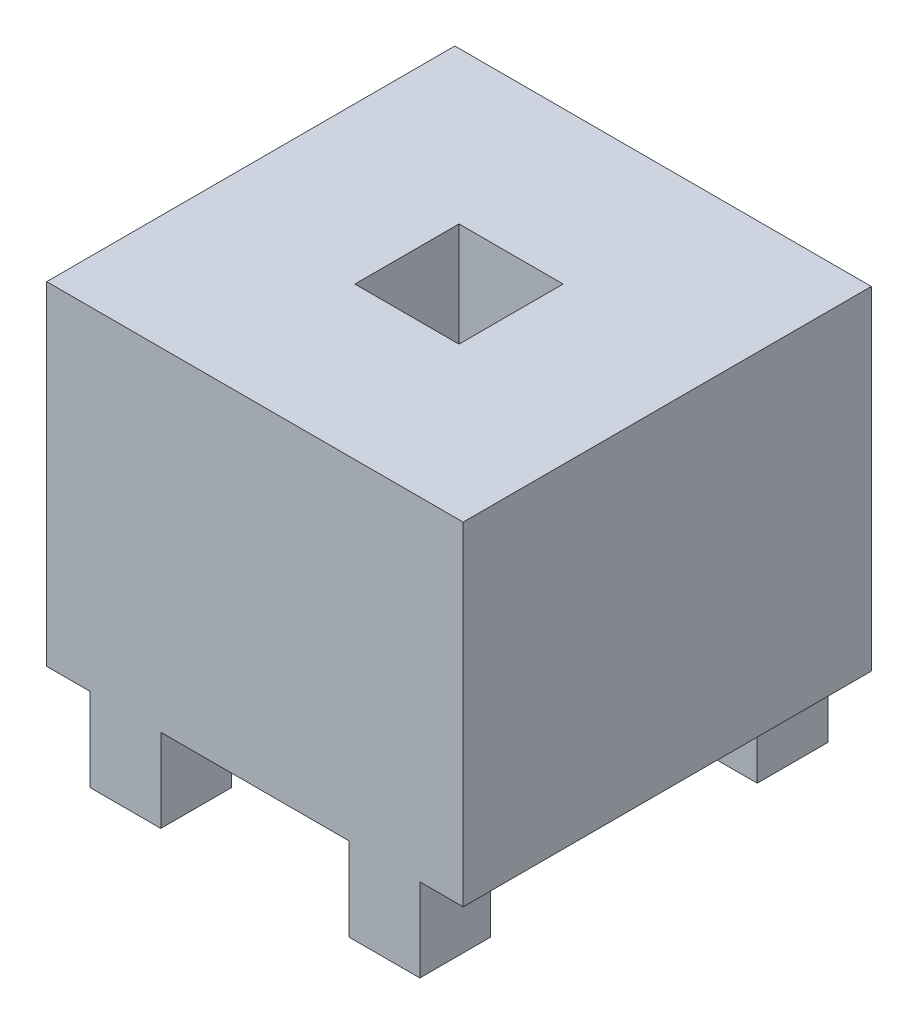
ISO-10303-21;
HEADER;
FILE_DESCRIPTION(('STEP AP214'),'2;1');
FILE_NAME('part.step','',(''),(''),'','','');
FILE_SCHEMA(('AUTOMOTIVE_DESIGN { 1 0 10303 214 1 1 1 1 }'));
ENDSEC;
DATA;
#1=APPLICATION_CONTEXT('core data for automotive mechanical design processes');
#2=APPLICATION_PROTOCOL_DEFINITION('international standard','automotive_design',2000,#1);
#3=PRODUCT_CONTEXT('',#1,'mechanical');
#4=PRODUCT('Part','Part','',(#3));
#5=PRODUCT_RELATED_PRODUCT_CATEGORY('part','',(#4));
#6=PRODUCT_DEFINITION_FORMATION('','',#4);
#7=PRODUCT_DEFINITION_CONTEXT('part definition',#1,'design');
#8=PRODUCT_DEFINITION('design','',#6,#7);
#9=PRODUCT_DEFINITION_SHAPE('','',#8);
#10=(LENGTH_UNIT() NAMED_UNIT(*) SI_UNIT(.MILLI.,.METRE.));
#11=(NAMED_UNIT(*) PLANE_ANGLE_UNIT() SI_UNIT($,.RADIAN.));
#12=(NAMED_UNIT(*) SI_UNIT($,.STERADIAN.) SOLID_ANGLE_UNIT());
#13=UNCERTAINTY_MEASURE_WITH_UNIT(LENGTH_MEASURE(1.E-05),#10,'distance_accuracy_value','');
#14=(GEOMETRIC_REPRESENTATION_CONTEXT(3) GLOBAL_UNCERTAINTY_ASSIGNED_CONTEXT((#13)) GLOBAL_UNIT_ASSIGNED_CONTEXT((#10,
#11,#12)) REPRESENTATION_CONTEXT('',''));
#15=CARTESIAN_POINT('',(0.,0.,0.));
#16=DIRECTION('',(0.,0.,1.));
#17=DIRECTION('',(1.,0.,0.));
#18=AXIS2_PLACEMENT_3D('',#15,#16,#17);
#19=CARTESIAN_POINT('',(2.54,0.508,0.8128));
#20=DIRECTION('',(0.,0.,-1.));
#21=DIRECTION('',(-1.,0.,0.));
#22=AXIS2_PLACEMENT_3D('',#19,#20,#21);
#23=PLANE('',#22);
#24=DIRECTION('',(-1.,0.,0.));
#25=VECTOR('',#24,1.);
#26=CARTESIAN_POINT('',(2.54,0.508,0.8128));
#27=LINE('',#26,#25);
#28=CARTESIAN_POINT('',(-0.57404,0.508,0.8128));
#29=VERTEX_POINT('',#28);
#30=CARTESIAN_POINT('',(-1.00584,0.508,0.8128));
#31=VERTEX_POINT('',#30);
#32=EDGE_CURVE('E11',#29,#31,#27,.T.);
#33=ORIENTED_EDGE('',*,*,#32,.F.);
#34=DIRECTION('',(0.,1.,0.));
#35=VECTOR('',#34,1.);
#36=CARTESIAN_POINT('',(-0.57404,0.508,0.8128));
#37=LINE('',#36,#35);
#38=CARTESIAN_POINT('',(-0.57404,0.,0.8128));
#39=VERTEX_POINT('',#38);
#40=EDGE_CURVE('E25',#39,#29,#37,.T.);
#41=ORIENTED_EDGE('',*,*,#40,.F.);
#42=DIRECTION('',(-1.,0.,0.));
#43=VECTOR('',#42,1.);
#44=CARTESIAN_POINT('',(0.,0.,0.8128));
#45=LINE('',#44,#43);
#46=CARTESIAN_POINT('',(-1.00584,0.,0.8128));
#47=VERTEX_POINT('',#46);
#48=EDGE_CURVE('E504',#39,#47,#45,.T.);
#49=ORIENTED_EDGE('',*,*,#48,.T.);
#50=DIRECTION('',(0.,-1.,0.));
#51=VECTOR('',#50,1.);
#52=CARTESIAN_POINT('',(-1.00584,0.,0.8128));
#53=LINE('',#52,#51);
#54=EDGE_CURVE('E499',#31,#47,#53,.T.);
#55=ORIENTED_EDGE('',*,*,#54,.F.);
#56=EDGE_LOOP('',(#33,#41,#49,#55));
#57=FACE_BOUND('',#56,.T.);
#58=ADVANCED_FACE('F17',(#57),#23,.T.);
#59=CARTESIAN_POINT('',(-1.00584,0.,2.4892));
#60=DIRECTION('',(-1.,0.,0.));
#61=DIRECTION('',(0.,0.,1.));
#62=AXIS2_PLACEMENT_3D('',#59,#60,#61);
#63=PLANE('',#62);
#64=DIRECTION('',(0.,0.,-1.));
#65=VECTOR('',#64,1.);
#66=CARTESIAN_POINT('',(-1.00584,0.508,2.4892));
#67=LINE('',#66,#65);
#68=CARTESIAN_POINT('',(-1.00584,0.508,1.2446));
#69=VERTEX_POINT('',#68);
#70=EDGE_CURVE('E494',#69,#31,#67,.T.);
#71=ORIENTED_EDGE('',*,*,#70,.T.);
#72=ORIENTED_EDGE('',*,*,#54,.T.);
#73=DIRECTION('',(0.,0.,1.));
#74=VECTOR('',#73,1.);
#75=CARTESIAN_POINT('',(-1.00584,0.,0.));
#76=LINE('',#75,#74);
#77=CARTESIAN_POINT('',(-1.00584,0.,1.2446));
#78=VERTEX_POINT('',#77);
#79=EDGE_CURVE('E490',#47,#78,#76,.T.);
#80=ORIENTED_EDGE('',*,*,#79,.T.);
#81=DIRECTION('',(0.,1.,0.));
#82=VECTOR('',#81,1.);
#83=CARTESIAN_POINT('',(-1.00584,2.54,1.2446));
#84=LINE('',#83,#82);
#85=EDGE_CURVE('E486',#78,#69,#84,.T.);
#86=ORIENTED_EDGE('',*,*,#85,.T.);
#87=EDGE_LOOP('',(#71,#72,#80,#86));
#88=FACE_BOUND('',#87,.T.);
#89=ADVANCED_FACE('F530',(#88),#63,.T.);
#90=CARTESIAN_POINT('',(-1.27,2.54,1.2446));
#91=DIRECTION('',(0.,0.,-1.));
#92=DIRECTION('',(-1.,0.,0.));
#93=AXIS2_PLACEMENT_3D('',#90,#91,#92);
#94=PLANE('',#93);
#95=DIRECTION('',(0.,-1.,0.));
#96=VECTOR('',#95,1.);
#97=CARTESIAN_POINT('',(-0.57404,2.54,1.2446));
#98=LINE('',#97,#96);
#99=CARTESIAN_POINT('',(-0.57404,0.508,1.2446));
#100=VERTEX_POINT('',#99);
#101=CARTESIAN_POINT('',(-0.57404,0.,1.2446));
#102=VERTEX_POINT('',#101);
#103=EDGE_CURVE('E481',#100,#102,#98,.T.);
#104=ORIENTED_EDGE('',*,*,#103,.F.);
#105=DIRECTION('',(-1.,0.,0.));
#106=VECTOR('',#105,1.);
#107=CARTESIAN_POINT('',(-1.27,0.508,1.2446));
#108=LINE('',#107,#106);
#109=CARTESIAN_POINT('',(0.57404,0.508,1.2446));
#110=VERTEX_POINT('',#109);
#111=EDGE_CURVE('E476',#110,#100,#108,.T.);
#112=ORIENTED_EDGE('',*,*,#111,.F.);
#113=DIRECTION('',(0.,1.,0.));
#114=VECTOR('',#113,1.);
#115=CARTESIAN_POINT('',(0.57404,2.54,1.2446));
#116=LINE('',#115,#114);
#117=CARTESIAN_POINT('',(0.57404,0.,1.2446));
#118=VERTEX_POINT('',#117);
#119=EDGE_CURVE('E471',#118,#110,#116,.T.);
#120=ORIENTED_EDGE('',*,*,#119,.F.);
#121=DIRECTION('',(1.,0.,0.));
#122=VECTOR('',#121,1.);
#123=CARTESIAN_POINT('',(-1.27,0.,1.2446));
#124=LINE('',#123,#122);
#125=CARTESIAN_POINT('',(1.00584,0.,1.2446));
#126=VERTEX_POINT('',#125);
#127=EDGE_CURVE('E467',#118,#126,#124,.T.);
#128=ORIENTED_EDGE('',*,*,#127,.T.);
#129=DIRECTION('',(0.,-1.,0.));
#130=VECTOR('',#129,1.);
#131=CARTESIAN_POINT('',(1.00584,2.54,1.2446));
#132=LINE('',#131,#130);
#133=CARTESIAN_POINT('',(1.00584,0.508,1.2446));
#134=VERTEX_POINT('',#133);
#135=EDGE_CURVE('E192',#134,#126,#132,.T.);
#136=ORIENTED_EDGE('',*,*,#135,.F.);
#137=DIRECTION('',(-1.,0.,0.));
#138=VECTOR('',#137,1.);
#139=CARTESIAN_POINT('',(-1.27,0.508,1.2446));
#140=LINE('',#139,#138);
#141=CARTESIAN_POINT('',(1.27,0.508,1.2446));
#142=VERTEX_POINT('',#141);
#143=EDGE_CURVE('E459',#142,#134,#140,.T.);
#144=ORIENTED_EDGE('',*,*,#143,.F.);
#145=DIRECTION('',(0.,-1.,0.));
#146=VECTOR('',#145,1.);
#147=CARTESIAN_POINT('',(1.27,2.54,1.2446));
#148=LINE('',#147,#146);
#149=CARTESIAN_POINT('',(1.27,2.54,1.2446));
#150=VERTEX_POINT('',#149);
#151=EDGE_CURVE('E454',#150,#142,#148,.T.);
#152=ORIENTED_EDGE('',*,*,#151,.F.);
#153=DIRECTION('',(1.,0.,0.));
#154=VECTOR('',#153,1.);
#155=CARTESIAN_POINT('',(-1.27,2.54,1.2446));
#156=LINE('',#155,#154);
#157=CARTESIAN_POINT('',(-1.27,2.54,1.2446));
#158=VERTEX_POINT('',#157);
#159=EDGE_CURVE('E449',#158,#150,#156,.T.);
#160=ORIENTED_EDGE('',*,*,#159,.F.);
#161=DIRECTION('',(0.,-1.,0.));
#162=VECTOR('',#161,1.);
#163=CARTESIAN_POINT('',(-1.27,2.54,1.2446));
#164=LINE('',#163,#162);
#165=CARTESIAN_POINT('',(-1.27,0.508,1.2446));
#166=VERTEX_POINT('',#165);
#167=EDGE_CURVE('E445',#158,#166,#164,.T.);
#168=ORIENTED_EDGE('',*,*,#167,.T.);
#169=DIRECTION('',(-1.,0.,0.));
#170=VECTOR('',#169,1.);
#171=CARTESIAN_POINT('',(-1.27,0.508,1.2446));
#172=LINE('',#171,#170);
#173=EDGE_CURVE('E440',#69,#166,#172,.T.);
#174=ORIENTED_EDGE('',*,*,#173,.F.);
#175=ORIENTED_EDGE('',*,*,#85,.F.);
#176=DIRECTION('',(1.,0.,0.));
#177=VECTOR('',#176,1.);
#178=CARTESIAN_POINT('',(-1.27,0.,1.2446));
#179=LINE('',#178,#177);
#180=EDGE_CURVE('E436',#78,#102,#179,.T.);
#181=ORIENTED_EDGE('',*,*,#180,.T.);
#182=EDGE_LOOP('',(#104,#112,#120,#128,#136,#144,#152,#160,#168,#174,#175,#181));
#183=FACE_BOUND('',#182,.T.);
#184=ADVANCED_FACE('F522',(#183),#94,.F.);
#185=CARTESIAN_POINT('',(0.,0.,0.));
#186=DIRECTION('',(0.,1.,0.));
#187=DIRECTION('',(0.,0.,1.));
#188=AXIS2_PLACEMENT_3D('',#185,#186,#187);
#189=PLANE('',#188);
#190=ORIENTED_EDGE('',*,*,#48,.F.);
#191=DIRECTION('',(0.,0.,-1.));
#192=VECTOR('',#191,1.);
#193=CARTESIAN_POINT('',(-0.57404,0.,0.));
#194=LINE('',#193,#192);
#195=EDGE_CURVE('E431',#102,#39,#194,.T.);
#196=ORIENTED_EDGE('',*,*,#195,.F.);
#197=ORIENTED_EDGE('',*,*,#180,.F.);
#198=ORIENTED_EDGE('',*,*,#79,.F.);
#199=EDGE_LOOP('',(#190,#196,#197,#198));
#200=FACE_BOUND('',#199,.T.);
#201=ADVANCED_FACE('F528',(#200),#189,.F.);
#202=CARTESIAN_POINT('',(-0.57404,0.508,2.4892));
#203=DIRECTION('',(1.,0.,0.));
#204=DIRECTION('',(0.,0.,-1.));
#205=AXIS2_PLACEMENT_3D('',#202,#203,#204);
#206=PLANE('',#205);
#207=ORIENTED_EDGE('',*,*,#195,.T.);
#208=ORIENTED_EDGE('',*,*,#40,.T.);
#209=DIRECTION('',(0.,0.,-1.));
#210=VECTOR('',#209,1.);
#211=CARTESIAN_POINT('',(-0.57404,0.508,2.4892));
#212=LINE('',#211,#210);
#213=EDGE_CURVE('E426',#100,#29,#212,.T.);
#214=ORIENTED_EDGE('',*,*,#213,.F.);
#215=ORIENTED_EDGE('',*,*,#103,.T.);
#216=EDGE_LOOP('',(#207,#208,#214,#215));
#217=FACE_BOUND('',#216,.T.);
#218=ADVANCED_FACE('F514',(#217),#206,.T.);
#219=CARTESIAN_POINT('',(-1.00584,0.508,2.4892));
#220=DIRECTION('',(0.,-1.,0.));
#221=DIRECTION('',(0.,0.,-1.));
#222=AXIS2_PLACEMENT_3D('',#219,#220,#221);
#223=PLANE('',#222);
#224=DIRECTION('',(0.,0.,-1.));
#225=VECTOR('',#224,1.);
#226=CARTESIAN_POINT('',(-1.00584,0.508,2.4892));
#227=LINE('',#226,#225);
#228=CARTESIAN_POINT('',(-1.00584,0.508,-0.8128));
#229=VERTEX_POINT('',#228);
#230=CARTESIAN_POINT('',(-1.00584,0.508,-1.2446));
#231=VERTEX_POINT('',#230);
#232=EDGE_CURVE('E421',#229,#231,#227,.T.);
#233=ORIENTED_EDGE('',*,*,#232,.F.);
#234=DIRECTION('',(-1.,0.,0.));
#235=VECTOR('',#234,1.);
#236=CARTESIAN_POINT('',(2.54,0.508,-0.8128));
#237=LINE('',#236,#235);
#238=CARTESIAN_POINT('',(-0.57404,0.508,-0.8128));
#239=VERTEX_POINT('',#238);
#240=EDGE_CURVE('E416',#239,#229,#237,.T.);
#241=ORIENTED_EDGE('',*,*,#240,.F.);
#242=DIRECTION('',(0.,0.,-1.));
#243=VECTOR('',#242,1.);
#244=CARTESIAN_POINT('',(-0.57404,0.508,2.4892));
#245=LINE('',#244,#243);
#246=CARTESIAN_POINT('',(-0.57404,0.508,-1.2446));
#247=VERTEX_POINT('',#246);
#248=EDGE_CURVE('E412',#239,#247,#245,.T.);
#249=ORIENTED_EDGE('',*,*,#248,.T.);
#250=DIRECTION('',(1.,0.,0.));
#251=VECTOR('',#250,1.);
#252=CARTESIAN_POINT('',(1.27,0.508,-1.2446));
#253=LINE('',#252,#251);
#254=CARTESIAN_POINT('',(0.57404,0.508,-1.2446));
#255=VERTEX_POINT('',#254);
#256=EDGE_CURVE('E408',#247,#255,#253,.T.);
#257=ORIENTED_EDGE('',*,*,#256,.T.);
#258=DIRECTION('',(0.,0.,-1.));
#259=VECTOR('',#258,1.);
#260=CARTESIAN_POINT('',(0.57404,0.508,2.4892));
#261=LINE('',#260,#259);
#262=CARTESIAN_POINT('',(0.57404,0.508,-0.8128));
#263=VERTEX_POINT('',#262);
#264=EDGE_CURVE('E403',#263,#255,#261,.T.);
#265=ORIENTED_EDGE('',*,*,#264,.F.);
#266=DIRECTION('',(-1.,0.,0.));
#267=VECTOR('',#266,1.);
#268=CARTESIAN_POINT('',(2.54,0.508,-0.8128));
#269=LINE('',#268,#267);
#270=CARTESIAN_POINT('',(1.00584,0.508,-0.8128));
#271=VERTEX_POINT('',#270);
#272=EDGE_CURVE('E398',#271,#263,#269,.T.);
#273=ORIENTED_EDGE('',*,*,#272,.F.);
#274=DIRECTION('',(0.,0.,-1.));
#275=VECTOR('',#274,1.);
#276=CARTESIAN_POINT('',(1.00584,0.508,2.4892));
#277=LINE('',#276,#275);
#278=CARTESIAN_POINT('',(1.00584,0.508,-1.2446));
#279=VERTEX_POINT('',#278);
#280=EDGE_CURVE('E394',#271,#279,#277,.T.);
#281=ORIENTED_EDGE('',*,*,#280,.T.);
#282=DIRECTION('',(1.,0.,0.));
#283=VECTOR('',#282,1.);
#284=CARTESIAN_POINT('',(1.27,0.508,-1.2446));
#285=LINE('',#284,#283);
#286=CARTESIAN_POINT('',(1.27,0.508,-1.2446));
#287=VERTEX_POINT('',#286);
#288=EDGE_CURVE('E390',#279,#287,#285,.T.);
#289=ORIENTED_EDGE('',*,*,#288,.T.);
#290=DIRECTION('',(0.,0.,1.));
#291=VECTOR('',#290,1.);
#292=CARTESIAN_POINT('',(1.27,0.508,1.2446));
#293=LINE('',#292,#291);
#294=EDGE_CURVE('E385',#287,#142,#293,.T.);
#295=ORIENTED_EDGE('',*,*,#294,.T.);
#296=ORIENTED_EDGE('',*,*,#143,.T.);
#297=DIRECTION('',(0.,0.,-1.));
#298=VECTOR('',#297,1.);
#299=CARTESIAN_POINT('',(1.00584,0.508,2.4892));
#300=LINE('',#299,#298);
#301=CARTESIAN_POINT('',(1.00584,0.508,0.8128));
#302=VERTEX_POINT('',#301);
#303=EDGE_CURVE('E381',#134,#302,#300,.T.);
#304=ORIENTED_EDGE('',*,*,#303,.T.);
#305=DIRECTION('',(-1.,0.,0.));
#306=VECTOR('',#305,1.);
#307=CARTESIAN_POINT('',(2.54,0.508,0.8128));
#308=LINE('',#307,#306);
#309=CARTESIAN_POINT('',(0.57404,0.508,0.8128));
#310=VERTEX_POINT('',#309);
#311=EDGE_CURVE('E195',#302,#310,#308,.T.);
#312=ORIENTED_EDGE('',*,*,#311,.T.);
#313=DIRECTION('',(0.,0.,-1.));
#314=VECTOR('',#313,1.);
#315=CARTESIAN_POINT('',(0.57404,0.508,2.4892));
#316=LINE('',#315,#314);
#317=EDGE_CURVE('E373',#110,#310,#316,.T.);
#318=ORIENTED_EDGE('',*,*,#317,.F.);
#319=ORIENTED_EDGE('',*,*,#111,.T.);
#320=ORIENTED_EDGE('',*,*,#213,.T.);
#321=ORIENTED_EDGE('',*,*,#32,.T.);
#322=ORIENTED_EDGE('',*,*,#70,.F.);
#323=ORIENTED_EDGE('',*,*,#173,.T.);
#324=DIRECTION('',(0.,0.,-1.));
#325=VECTOR('',#324,1.);
#326=CARTESIAN_POINT('',(-1.27,0.508,-1.2446));
#327=LINE('',#326,#325);
#328=CARTESIAN_POINT('',(-1.27,0.508,-1.2446));
#329=VERTEX_POINT('',#328);
#330=EDGE_CURVE('E369',#166,#329,#327,.T.);
#331=ORIENTED_EDGE('',*,*,#330,.T.);
#332=DIRECTION('',(1.,0.,0.));
#333=VECTOR('',#332,1.);
#334=CARTESIAN_POINT('',(1.27,0.508,-1.2446));
#335=LINE('',#334,#333);
#336=EDGE_CURVE('E365',#329,#231,#335,.T.);
#337=ORIENTED_EDGE('',*,*,#336,.T.);
#338=EDGE_LOOP('',(#233,#241,#249,#257,#265,#273,#281,#289,#295,#296,#304,#312,#318,#319,#320,
#321,#322,#323,#331,#337));
#339=FACE_BOUND('',#338,.T.);
#340=DIRECTION('',(0.,0.,-1.));
#341=VECTOR('',#340,1.);
#342=CARTESIAN_POINT('',(-0.3175,0.508,-0.3175));
#343=LINE('',#342,#341);
#344=CARTESIAN_POINT('',(-0.3175,0.508,0.3175));
#345=VERTEX_POINT('',#344);
#346=CARTESIAN_POINT('',(-0.3175,0.508,-0.3175));
#347=VERTEX_POINT('',#346);
#348=EDGE_CURVE('E360',#345,#347,#343,.T.);
#349=ORIENTED_EDGE('',*,*,#348,.F.);
#350=DIRECTION('',(-1.,0.,0.));
#351=VECTOR('',#350,1.);
#352=CARTESIAN_POINT('',(-0.3175,0.508,0.3175));
#353=LINE('',#352,#351);
#354=CARTESIAN_POINT('',(0.3175,0.508,0.3175));
#355=VERTEX_POINT('',#354);
#356=EDGE_CURVE('E355',#355,#345,#353,.T.);
#357=ORIENTED_EDGE('',*,*,#356,.F.);
#358=DIRECTION('',(0.,0.,1.));
#359=VECTOR('',#358,1.);
#360=CARTESIAN_POINT('',(0.3175,0.508,0.3175));
#361=LINE('',#360,#359);
#362=CARTESIAN_POINT('',(0.3175,0.508,-0.3175));
#363=VERTEX_POINT('',#362);
#364=EDGE_CURVE('E350',#363,#355,#361,.T.);
#365=ORIENTED_EDGE('',*,*,#364,.F.);
#366=DIRECTION('',(1.,0.,0.));
#367=VECTOR('',#366,1.);
#368=CARTESIAN_POINT('',(0.3175,0.508,-0.3175));
#369=LINE('',#368,#367);
#370=EDGE_CURVE('E345',#347,#363,#369,.T.);
#371=ORIENTED_EDGE('',*,*,#370,.F.);
#372=EDGE_LOOP('',(#349,#357,#365,#371));
#373=FACE_BOUND('',#372,.T.);
#374=ADVANCED_FACE('F517',(#339,#373),#223,.T.);
#375=CARTESIAN_POINT('',(0.3175,2.54,-0.3175));
#376=DIRECTION('',(0.,0.,1.));
#377=DIRECTION('',(1.,0.,0.));
#378=AXIS2_PLACEMENT_3D('',#375,#376,#377);
#379=PLANE('',#378);
#380=DIRECTION('',(0.,-1.,0.));
#381=VECTOR('',#380,1.);
#382=CARTESIAN_POINT('',(-0.3175,2.54,-0.3175));
#383=LINE('',#382,#381);
#384=CARTESIAN_POINT('',(-0.3175,2.54,-0.3175));
#385=VERTEX_POINT('',#384);
#386=EDGE_CURVE('E340',#385,#347,#383,.T.);
#387=ORIENTED_EDGE('',*,*,#386,.T.);
#388=ORIENTED_EDGE('',*,*,#370,.T.);
#389=DIRECTION('',(0.,-1.,0.));
#390=VECTOR('',#389,1.);
#391=CARTESIAN_POINT('',(0.3175,2.54,-0.3175));
#392=LINE('',#391,#390);
#393=CARTESIAN_POINT('',(0.3175,2.54,-0.3175));
#394=VERTEX_POINT('',#393);
#395=EDGE_CURVE('E335',#394,#363,#392,.T.);
#396=ORIENTED_EDGE('',*,*,#395,.F.);
#397=DIRECTION('',(-1.,0.,0.));
#398=VECTOR('',#397,1.);
#399=CARTESIAN_POINT('',(0.3175,2.54,-0.3175));
#400=LINE('',#399,#398);
#401=EDGE_CURVE('E331',#394,#385,#400,.T.);
#402=ORIENTED_EDGE('',*,*,#401,.T.);
#403=EDGE_LOOP('',(#387,#388,#396,#402));
#404=FACE_BOUND('',#403,.T.);
#405=ADVANCED_FACE('F578',(#404),#379,.T.);
#406=CARTESIAN_POINT('',(0.,2.54,0.));
#407=DIRECTION('',(0.,1.,0.));
#408=DIRECTION('',(0.,0.,1.));
#409=AXIS2_PLACEMENT_3D('',#406,#407,#408);
#410=PLANE('',#409);
#411=ORIENTED_EDGE('',*,*,#401,.F.);
#412=DIRECTION('',(0.,0.,-1.));
#413=VECTOR('',#412,1.);
#414=CARTESIAN_POINT('',(0.3175,2.54,0.3175));
#415=LINE('',#414,#413);
#416=CARTESIAN_POINT('',(0.3175,2.54,0.3175));
#417=VERTEX_POINT('',#416);
#418=EDGE_CURVE('E326',#417,#394,#415,.T.);
#419=ORIENTED_EDGE('',*,*,#418,.F.);
#420=DIRECTION('',(1.,0.,0.));
#421=VECTOR('',#420,1.);
#422=CARTESIAN_POINT('',(-0.3175,2.54,0.3175));
#423=LINE('',#422,#421);
#424=CARTESIAN_POINT('',(-0.3175,2.54,0.3175));
#425=VERTEX_POINT('',#424);
#426=EDGE_CURVE('E321',#425,#417,#423,.T.);
#427=ORIENTED_EDGE('',*,*,#426,.F.);
#428=DIRECTION('',(0.,0.,1.));
#429=VECTOR('',#428,1.);
#430=CARTESIAN_POINT('',(-0.3175,2.54,-0.3175));
#431=LINE('',#430,#429);
#432=EDGE_CURVE('E316',#385,#425,#431,.T.);
#433=ORIENTED_EDGE('',*,*,#432,.F.);
#434=EDGE_LOOP('',(#411,#419,#427,#433));
#435=FACE_BOUND('',#434,.T.);
#436=DIRECTION('',(-1.,0.,0.));
#437=VECTOR('',#436,1.);
#438=CARTESIAN_POINT('',(1.27,2.54,-1.2446));
#439=LINE('',#438,#437);
#440=CARTESIAN_POINT('',(1.27,2.54,-1.2446));
#441=VERTEX_POINT('',#440);
#442=CARTESIAN_POINT('',(-1.27,2.54,-1.2446));
#443=VERTEX_POINT('',#442);
#444=EDGE_CURVE('E312',#441,#443,#439,.T.);
#445=ORIENTED_EDGE('',*,*,#444,.T.);
#446=DIRECTION('',(0.,0.,1.));
#447=VECTOR('',#446,1.);
#448=CARTESIAN_POINT('',(-1.27,2.54,-1.2446));
#449=LINE('',#448,#447);
#450=EDGE_CURVE('E307',#443,#158,#449,.T.);
#451=ORIENTED_EDGE('',*,*,#450,.T.);
#452=ORIENTED_EDGE('',*,*,#159,.T.);
#453=DIRECTION('',(0.,0.,-1.));
#454=VECTOR('',#453,1.);
#455=CARTESIAN_POINT('',(1.27,2.54,1.2446));
#456=LINE('',#455,#454);
#457=EDGE_CURVE('E303',#150,#441,#456,.T.);
#458=ORIENTED_EDGE('',*,*,#457,.T.);
#459=EDGE_LOOP('',(#445,#451,#452,#458));
#460=FACE_BOUND('',#459,.T.);
#461=ADVANCED_FACE('F576',(#435,#460),#410,.T.);
#462=CARTESIAN_POINT('',(1.27,2.54,1.2446));
#463=DIRECTION('',(-1.,0.,0.));
#464=DIRECTION('',(0.,0.,1.));
#465=AXIS2_PLACEMENT_3D('',#462,#463,#464);
#466=PLANE('',#465);
#467=ORIENTED_EDGE('',*,*,#294,.F.);
#468=DIRECTION('',(0.,-1.,0.));
#469=VECTOR('',#468,1.);
#470=CARTESIAN_POINT('',(1.27,2.54,-1.2446));
#471=LINE('',#470,#469);
#472=EDGE_CURVE('E298',#441,#287,#471,.T.);
#473=ORIENTED_EDGE('',*,*,#472,.F.);
#474=ORIENTED_EDGE('',*,*,#457,.F.);
#475=ORIENTED_EDGE('',*,*,#151,.T.);
#476=EDGE_LOOP('',(#467,#473,#474,#475));
#477=FACE_BOUND('',#476,.T.);
#478=ADVANCED_FACE('F573',(#477),#466,.F.);
#479=CARTESIAN_POINT('',(1.27,2.54,-1.2446));
#480=DIRECTION('',(0.,0.,1.));
#481=DIRECTION('',(1.,0.,0.));
#482=AXIS2_PLACEMENT_3D('',#479,#480,#481);
#483=PLANE('',#482);
#484=DIRECTION('',(0.,1.,0.));
#485=VECTOR('',#484,1.);
#486=CARTESIAN_POINT('',(-0.57404,2.54,-1.2446));
#487=LINE('',#486,#485);
#488=CARTESIAN_POINT('',(-0.57404,0.,-1.2446));
#489=VERTEX_POINT('',#488);
#490=EDGE_CURVE('E293',#489,#247,#487,.T.);
#491=ORIENTED_EDGE('',*,*,#490,.F.);
#492=DIRECTION('',(-1.,0.,0.));
#493=VECTOR('',#492,1.);
#494=CARTESIAN_POINT('',(1.27,0.,-1.2446));
#495=LINE('',#494,#493);
#496=CARTESIAN_POINT('',(-1.00584,0.,-1.2446));
#497=VERTEX_POINT('',#496);
#498=EDGE_CURVE('E289',#489,#497,#495,.T.);
#499=ORIENTED_EDGE('',*,*,#498,.T.);
#500=DIRECTION('',(0.,-1.,0.));
#501=VECTOR('',#500,1.);
#502=CARTESIAN_POINT('',(-1.00584,2.54,-1.2446));
#503=LINE('',#502,#501);
#504=EDGE_CURVE('E284',#231,#497,#503,.T.);
#505=ORIENTED_EDGE('',*,*,#504,.F.);
#506=ORIENTED_EDGE('',*,*,#336,.F.);
#507=DIRECTION('',(0.,-1.,0.));
#508=VECTOR('',#507,1.);
#509=CARTESIAN_POINT('',(-1.27,2.54,-1.2446));
#510=LINE('',#509,#508);
#511=EDGE_CURVE('E279',#443,#329,#510,.T.);
#512=ORIENTED_EDGE('',*,*,#511,.F.);
#513=ORIENTED_EDGE('',*,*,#444,.F.);
#514=ORIENTED_EDGE('',*,*,#472,.T.);
#515=ORIENTED_EDGE('',*,*,#288,.F.);
#516=DIRECTION('',(0.,1.,0.));
#517=VECTOR('',#516,1.);
#518=CARTESIAN_POINT('',(1.00584,2.54,-1.2446));
#519=LINE('',#518,#517);
#520=CARTESIAN_POINT('',(1.00584,0.,-1.2446));
#521=VERTEX_POINT('',#520);
#522=EDGE_CURVE('E274',#521,#279,#519,.T.);
#523=ORIENTED_EDGE('',*,*,#522,.F.);
#524=DIRECTION('',(-1.,0.,0.));
#525=VECTOR('',#524,1.);
#526=CARTESIAN_POINT('',(1.27,0.,-1.2446));
#527=LINE('',#526,#525);
#528=CARTESIAN_POINT('',(0.57404,0.,-1.2446));
#529=VERTEX_POINT('',#528);
#530=EDGE_CURVE('E270',#521,#529,#527,.T.);
#531=ORIENTED_EDGE('',*,*,#530,.T.);
#532=DIRECTION('',(0.,-1.,0.));
#533=VECTOR('',#532,1.);
#534=CARTESIAN_POINT('',(0.57404,2.54,-1.2446));
#535=LINE('',#534,#533);
#536=EDGE_CURVE('E265',#255,#529,#535,.T.);
#537=ORIENTED_EDGE('',*,*,#536,.F.);
#538=ORIENTED_EDGE('',*,*,#256,.F.);
#539=EDGE_LOOP('',(#491,#499,#505,#506,#512,#513,#514,#515,#523,#531,#537,#538));
#540=FACE_BOUND('',#539,.T.);
#541=ADVANCED_FACE('F540',(#540),#483,.F.);
#542=CARTESIAN_POINT('',(0.57404,-0.254,2.4892));
#543=DIRECTION('',(-1.,0.,0.));
#544=DIRECTION('',(0.,0.,1.));
#545=AXIS2_PLACEMENT_3D('',#542,#543,#544);
#546=PLANE('',#545);
#547=DIRECTION('',(0.,0.,1.));
#548=VECTOR('',#547,1.);
#549=CARTESIAN_POINT('',(0.57404,0.,0.));
#550=LINE('',#549,#548);
#551=CARTESIAN_POINT('',(0.57404,0.,-0.8128));
#552=VERTEX_POINT('',#551);
#553=EDGE_CURVE('E261',#529,#552,#550,.T.);
#554=ORIENTED_EDGE('',*,*,#553,.T.);
#555=DIRECTION('',(0.,1.,0.));
#556=VECTOR('',#555,1.);
#557=CARTESIAN_POINT('',(0.57404,-0.254,-0.8128));
#558=LINE('',#557,#556);
#559=EDGE_CURVE('E256',#552,#263,#558,.T.);
#560=ORIENTED_EDGE('',*,*,#559,.T.);
#561=ORIENTED_EDGE('',*,*,#264,.T.);
#562=ORIENTED_EDGE('',*,*,#536,.T.);
#563=EDGE_LOOP('',(#554,#560,#561,#562));
#564=FACE_BOUND('',#563,.T.);
#565=ADVANCED_FACE('F559',(#564),#546,.T.);
#566=CARTESIAN_POINT('',(2.54,-0.254,-0.8128));
#567=DIRECTION('',(0.,0.,1.));
#568=DIRECTION('',(1.,0.,0.));
#569=AXIS2_PLACEMENT_3D('',#566,#567,#568);
#570=PLANE('',#569);
#571=ORIENTED_EDGE('',*,*,#272,.T.);
#572=ORIENTED_EDGE('',*,*,#559,.F.);
#573=DIRECTION('',(1.,0.,0.));
#574=VECTOR('',#573,1.);
#575=CARTESIAN_POINT('',(0.,0.,-0.8128));
#576=LINE('',#575,#574);
#577=CARTESIAN_POINT('',(1.00584,0.,-0.8128));
#578=VERTEX_POINT('',#577);
#579=EDGE_CURVE('E252',#552,#578,#576,.T.);
#580=ORIENTED_EDGE('',*,*,#579,.T.);
#581=DIRECTION('',(0.,-1.,0.));
#582=VECTOR('',#581,1.);
#583=CARTESIAN_POINT('',(1.00584,0.508,-0.8128));
#584=LINE('',#583,#582);
#585=EDGE_CURVE('E247',#271,#578,#584,.T.);
#586=ORIENTED_EDGE('',*,*,#585,.F.);
#587=EDGE_LOOP('',(#571,#572,#580,#586));
#588=FACE_BOUND('',#587,.T.);
#589=ADVANCED_FACE('F565',(#588),#570,.T.);
#590=CARTESIAN_POINT('',(1.00584,0.508,2.4892));
#591=DIRECTION('',(1.,0.,0.));
#592=DIRECTION('',(0.,0.,-1.));
#593=AXIS2_PLACEMENT_3D('',#590,#591,#592);
#594=PLANE('',#593);
#595=ORIENTED_EDGE('',*,*,#280,.F.);
#596=ORIENTED_EDGE('',*,*,#585,.T.);
#597=DIRECTION('',(0.,0.,-1.));
#598=VECTOR('',#597,1.);
#599=CARTESIAN_POINT('',(1.00584,0.,0.));
#600=LINE('',#599,#598);
#601=EDGE_CURVE('E242',#578,#521,#600,.T.);
#602=ORIENTED_EDGE('',*,*,#601,.T.);
#603=ORIENTED_EDGE('',*,*,#522,.T.);
#604=EDGE_LOOP('',(#595,#596,#602,#603));
#605=FACE_BOUND('',#604,.T.);
#606=ADVANCED_FACE('F569',(#605),#594,.T.);
#607=CARTESIAN_POINT('',(0.,0.,0.));
#608=DIRECTION('',(0.,1.,0.));
#609=DIRECTION('',(0.,0.,1.));
#610=AXIS2_PLACEMENT_3D('',#607,#608,#609);
#611=PLANE('',#610);
#612=ORIENTED_EDGE('',*,*,#579,.F.);
#613=ORIENTED_EDGE('',*,*,#553,.F.);
#614=ORIENTED_EDGE('',*,*,#530,.F.);
#615=ORIENTED_EDGE('',*,*,#601,.F.);
#616=EDGE_LOOP('',(#612,#613,#614,#615));
#617=FACE_BOUND('',#616,.T.);
#618=ADVANCED_FACE('F660',(#617),#611,.F.);
#619=CARTESIAN_POINT('',(-1.27,2.54,-1.2446));
#620=DIRECTION('',(1.,0.,0.));
#621=DIRECTION('',(0.,0.,-1.));
#622=AXIS2_PLACEMENT_3D('',#619,#620,#621);
#623=PLANE('',#622);
#624=ORIENTED_EDGE('',*,*,#330,.F.);
#625=ORIENTED_EDGE('',*,*,#167,.F.);
#626=ORIENTED_EDGE('',*,*,#450,.F.);
#627=ORIENTED_EDGE('',*,*,#511,.T.);
#628=EDGE_LOOP('',(#624,#625,#626,#627));
#629=FACE_BOUND('',#628,.T.);
#630=ADVANCED_FACE('F535',(#629),#623,.F.);
#631=CARTESIAN_POINT('',(-1.00584,0.,2.4892));
#632=DIRECTION('',(-1.,0.,0.));
#633=DIRECTION('',(0.,0.,1.));
#634=AXIS2_PLACEMENT_3D('',#631,#632,#633);
#635=PLANE('',#634);
#636=DIRECTION('',(0.,0.,1.));
#637=VECTOR('',#636,1.);
#638=CARTESIAN_POINT('',(-1.00584,0.,0.));
#639=LINE('',#638,#637);
#640=CARTESIAN_POINT('',(-1.00584,0.,-0.8128));
#641=VERTEX_POINT('',#640);
#642=EDGE_CURVE('E238',#497,#641,#639,.T.);
#643=ORIENTED_EDGE('',*,*,#642,.T.);
#644=DIRECTION('',(0.,1.,0.));
#645=VECTOR('',#644,1.);
#646=CARTESIAN_POINT('',(-1.00584,0.,-0.8128));
#647=LINE('',#646,#645);
#648=EDGE_CURVE('E233',#641,#229,#647,.T.);
#649=ORIENTED_EDGE('',*,*,#648,.T.);
#650=ORIENTED_EDGE('',*,*,#232,.T.);
#651=ORIENTED_EDGE('',*,*,#504,.T.);
#652=EDGE_LOOP('',(#643,#649,#650,#651));
#653=FACE_BOUND('',#652,.T.);
#654=ADVANCED_FACE('F545',(#653),#635,.T.);
#655=CARTESIAN_POINT('',(2.54,-0.254,-0.8128));
#656=DIRECTION('',(0.,0.,1.));
#657=DIRECTION('',(1.,0.,0.));
#658=AXIS2_PLACEMENT_3D('',#655,#656,#657);
#659=PLANE('',#658);
#660=DIRECTION('',(1.,0.,0.));
#661=VECTOR('',#660,1.);
#662=CARTESIAN_POINT('',(0.,0.,-0.8128));
#663=LINE('',#662,#661);
#664=CARTESIAN_POINT('',(-0.57404,0.,-0.8128));
#665=VERTEX_POINT('',#664);
#666=EDGE_CURVE('E229',#641,#665,#663,.T.);
#667=ORIENTED_EDGE('',*,*,#666,.T.);
#668=DIRECTION('',(0.,-1.,0.));
#669=VECTOR('',#668,1.);
#670=CARTESIAN_POINT('',(-0.57404,0.508,-0.8128));
#671=LINE('',#670,#669);
#672=EDGE_CURVE('E224',#239,#665,#671,.T.);
#673=ORIENTED_EDGE('',*,*,#672,.F.);
#674=ORIENTED_EDGE('',*,*,#240,.T.);
#675=ORIENTED_EDGE('',*,*,#648,.F.);
#676=EDGE_LOOP('',(#667,#673,#674,#675));
#677=FACE_BOUND('',#676,.T.);
#678=ADVANCED_FACE('F549',(#677),#659,.T.);
#679=CARTESIAN_POINT('',(-0.57404,0.508,2.4892));
#680=DIRECTION('',(1.,0.,0.));
#681=DIRECTION('',(0.,0.,-1.));
#682=AXIS2_PLACEMENT_3D('',#679,#680,#681);
#683=PLANE('',#682);
#684=ORIENTED_EDGE('',*,*,#248,.F.);
#685=ORIENTED_EDGE('',*,*,#672,.T.);
#686=DIRECTION('',(0.,0.,-1.));
#687=VECTOR('',#686,1.);
#688=CARTESIAN_POINT('',(-0.57404,0.,0.));
#689=LINE('',#688,#687);
#690=EDGE_CURVE('E219',#665,#489,#689,.T.);
#691=ORIENTED_EDGE('',*,*,#690,.T.);
#692=ORIENTED_EDGE('',*,*,#490,.T.);
#693=EDGE_LOOP('',(#684,#685,#691,#692));
#694=FACE_BOUND('',#693,.T.);
#695=ADVANCED_FACE('F553',(#694),#683,.T.);
#696=CARTESIAN_POINT('',(0.,0.,0.));
#697=DIRECTION('',(0.,1.,0.));
#698=DIRECTION('',(0.,0.,1.));
#699=AXIS2_PLACEMENT_3D('',#696,#697,#698);
#700=PLANE('',#699);
#701=ORIENTED_EDGE('',*,*,#666,.F.);
#702=ORIENTED_EDGE('',*,*,#642,.F.);
#703=ORIENTED_EDGE('',*,*,#498,.F.);
#704=ORIENTED_EDGE('',*,*,#690,.F.);
#705=EDGE_LOOP('',(#701,#702,#703,#704));
#706=FACE_BOUND('',#705,.T.);
#707=ADVANCED_FACE('F702',(#706),#700,.F.);
#708=CARTESIAN_POINT('',(-0.3175,2.54,-0.3175));
#709=DIRECTION('',(1.,0.,0.));
#710=DIRECTION('',(0.,0.,-1.));
#711=AXIS2_PLACEMENT_3D('',#708,#709,#710);
#712=PLANE('',#711);
#713=DIRECTION('',(0.,-1.,0.));
#714=VECTOR('',#713,1.);
#715=CARTESIAN_POINT('',(-0.3175,2.54,0.3175));
#716=LINE('',#715,#714);
#717=EDGE_CURVE('E214',#425,#345,#716,.T.);
#718=ORIENTED_EDGE('',*,*,#717,.T.);
#719=ORIENTED_EDGE('',*,*,#348,.T.);
#720=ORIENTED_EDGE('',*,*,#386,.F.);
#721=ORIENTED_EDGE('',*,*,#432,.T.);
#722=EDGE_LOOP('',(#718,#719,#720,#721));
#723=FACE_BOUND('',#722,.T.);
#724=ADVANCED_FACE('F711',(#723),#712,.T.);
#725=CARTESIAN_POINT('',(-0.3175,2.54,0.3175));
#726=DIRECTION('',(0.,0.,-1.));
#727=DIRECTION('',(-1.,0.,0.));
#728=AXIS2_PLACEMENT_3D('',#725,#726,#727);
#729=PLANE('',#728);
#730=DIRECTION('',(0.,-1.,0.));
#731=VECTOR('',#730,1.);
#732=CARTESIAN_POINT('',(0.3175,2.54,0.3175));
#733=LINE('',#732,#731);
#734=EDGE_CURVE('E209',#417,#355,#733,.T.);
#735=ORIENTED_EDGE('',*,*,#734,.T.);
#736=ORIENTED_EDGE('',*,*,#356,.T.);
#737=ORIENTED_EDGE('',*,*,#717,.F.);
#738=ORIENTED_EDGE('',*,*,#426,.T.);
#739=EDGE_LOOP('',(#735,#736,#737,#738));
#740=FACE_BOUND('',#739,.T.);
#741=ADVANCED_FACE('F721',(#740),#729,.T.);
#742=CARTESIAN_POINT('',(0.3175,2.54,0.3175));
#743=DIRECTION('',(-1.,0.,0.));
#744=DIRECTION('',(0.,0.,1.));
#745=AXIS2_PLACEMENT_3D('',#742,#743,#744);
#746=PLANE('',#745);
#747=ORIENTED_EDGE('',*,*,#395,.T.);
#748=ORIENTED_EDGE('',*,*,#364,.T.);
#749=ORIENTED_EDGE('',*,*,#734,.F.);
#750=ORIENTED_EDGE('',*,*,#418,.T.);
#751=EDGE_LOOP('',(#747,#748,#749,#750));
#752=FACE_BOUND('',#751,.T.);
#753=ADVANCED_FACE('F731',(#752),#746,.T.);
#754=CARTESIAN_POINT('',(0.57404,-0.254,2.4892));
#755=DIRECTION('',(-1.,0.,0.));
#756=DIRECTION('',(0.,0.,1.));
#757=AXIS2_PLACEMENT_3D('',#754,#755,#756);
#758=PLANE('',#757);
#759=ORIENTED_EDGE('',*,*,#317,.T.);
#760=DIRECTION('',(0.,-1.,0.));
#761=VECTOR('',#760,1.);
#762=CARTESIAN_POINT('',(0.57404,-0.254,0.8128));
#763=LINE('',#762,#761);
#764=CARTESIAN_POINT('',(0.57404,0.,0.8128));
#765=VERTEX_POINT('',#764);
#766=EDGE_CURVE('E205',#310,#765,#763,.T.);
#767=ORIENTED_EDGE('',*,*,#766,.T.);
#768=DIRECTION('',(0.,0.,1.));
#769=VECTOR('',#768,1.);
#770=CARTESIAN_POINT('',(0.57404,0.,0.));
#771=LINE('',#770,#769);
#772=EDGE_CURVE('E181',#765,#118,#771,.T.);
#773=ORIENTED_EDGE('',*,*,#772,.T.);
#774=ORIENTED_EDGE('',*,*,#119,.T.);
#775=EDGE_LOOP('',(#759,#767,#773,#774));
#776=FACE_BOUND('',#775,.T.);
#777=ADVANCED_FACE('F741',(#776),#758,.T.);
#778=CARTESIAN_POINT('',(0.,0.,0.));
#779=DIRECTION('',(0.,1.,0.));
#780=DIRECTION('',(0.,0.,1.));
#781=AXIS2_PLACEMENT_3D('',#778,#779,#780);
#782=PLANE('',#781);
#783=DIRECTION('',(-1.,0.,0.));
#784=VECTOR('',#783,1.);
#785=CARTESIAN_POINT('',(0.,0.,0.8128));
#786=LINE('',#785,#784);
#787=CARTESIAN_POINT('',(1.00584,0.,0.8128));
#788=VERTEX_POINT('',#787);
#789=EDGE_CURVE('E174',#788,#765,#786,.T.);
#790=ORIENTED_EDGE('',*,*,#789,.F.);
#791=DIRECTION('',(0.,0.,-1.));
#792=VECTOR('',#791,1.);
#793=CARTESIAN_POINT('',(1.00584,0.,0.));
#794=LINE('',#793,#792);
#795=EDGE_CURVE('E178',#126,#788,#794,.T.);
#796=ORIENTED_EDGE('',*,*,#795,.F.);
#797=ORIENTED_EDGE('',*,*,#127,.F.);
#798=ORIENTED_EDGE('',*,*,#772,.F.);
#799=EDGE_LOOP('',(#790,#796,#797,#798));
#800=FACE_BOUND('',#799,.T.);
#801=ADVANCED_FACE('F176',(#800),#782,.F.);
#802=CARTESIAN_POINT('',(1.00584,0.508,2.4892));
#803=DIRECTION('',(1.,0.,0.));
#804=DIRECTION('',(0.,0.,-1.));
#805=AXIS2_PLACEMENT_3D('',#802,#803,#804);
#806=PLANE('',#805);
#807=ORIENTED_EDGE('',*,*,#795,.T.);
#808=DIRECTION('',(0.,1.,0.));
#809=VECTOR('',#808,1.);
#810=CARTESIAN_POINT('',(1.00584,0.508,0.8128));
#811=LINE('',#810,#809);
#812=EDGE_CURVE('E190',#788,#302,#811,.T.);
#813=ORIENTED_EDGE('',*,*,#812,.T.);
#814=ORIENTED_EDGE('',*,*,#303,.F.);
#815=ORIENTED_EDGE('',*,*,#135,.T.);
#816=EDGE_LOOP('',(#807,#813,#814,#815));
#817=FACE_BOUND('',#816,.T.);
#818=ADVANCED_FACE('F188',(#817),#806,.T.);
#819=CARTESIAN_POINT('',(2.54,0.508,0.8128));
#820=DIRECTION('',(0.,0.,-1.));
#821=DIRECTION('',(-1.,0.,0.));
#822=AXIS2_PLACEMENT_3D('',#819,#820,#821);
#823=PLANE('',#822);
#824=ORIENTED_EDGE('',*,*,#789,.T.);
#825=ORIENTED_EDGE('',*,*,#766,.F.);
#826=ORIENTED_EDGE('',*,*,#311,.F.);
#827=ORIENTED_EDGE('',*,*,#812,.F.);
#828=EDGE_LOOP('',(#824,#825,#826,#827));
#829=FACE_BOUND('',#828,.T.);
#830=ADVANCED_FACE('F194',(#829),#823,.T.);
#831=CLOSED_SHELL('',(#58,#89,#184,#201,#218,#374,#405,#461,#478,#541,#565,#589,#606,#618,#630,
#654,#678,#695,#707,#724,#741,#753,#777,#801,#818,#830));
#832=MANIFOLD_SOLID_BREP('B1',#831);
#833=ADVANCED_BREP_SHAPE_REPRESENTATION('',(#18,#832),#14);
#834=SHAPE_DEFINITION_REPRESENTATION(#9,#833);
ENDSEC;
END-ISO-10303-21;
